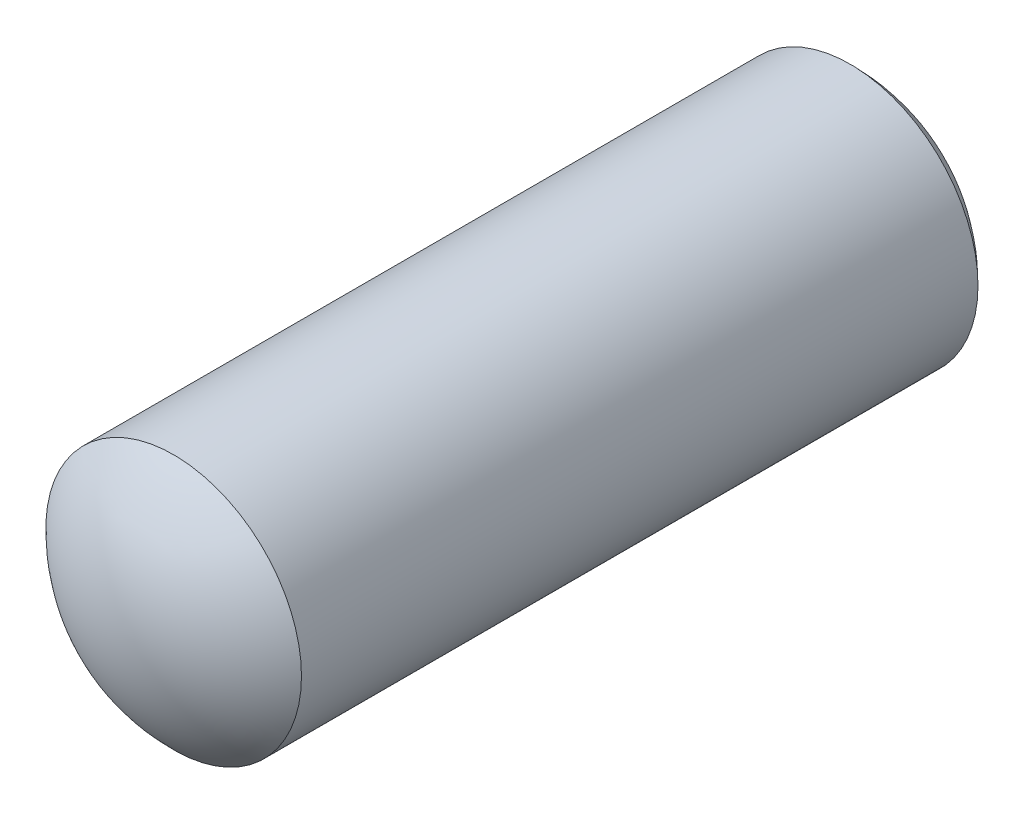
ISO-10303-21;
HEADER;
FILE_DESCRIPTION(('STEP AP214'),'2;1');
FILE_NAME('part.step','',(''),(''),'','','');
FILE_SCHEMA(('AUTOMOTIVE_DESIGN { 1 0 10303 214 1 1 1 1 }'));
ENDSEC;
DATA;
#1=APPLICATION_CONTEXT('core data for automotive mechanical design processes');
#2=APPLICATION_PROTOCOL_DEFINITION('international standard','automotive_design',2000,#1);
#3=PRODUCT_CONTEXT('',#1,'mechanical');
#4=PRODUCT('Part','Part','',(#3));
#5=PRODUCT_RELATED_PRODUCT_CATEGORY('part','',(#4));
#6=PRODUCT_DEFINITION_FORMATION('','',#4);
#7=PRODUCT_DEFINITION_CONTEXT('part definition',#1,'design');
#8=PRODUCT_DEFINITION('design','',#6,#7);
#9=PRODUCT_DEFINITION_SHAPE('','',#8);
#10=(LENGTH_UNIT() NAMED_UNIT(*) SI_UNIT(.MILLI.,.METRE.));
#11=(NAMED_UNIT(*) PLANE_ANGLE_UNIT() SI_UNIT($,.RADIAN.));
#12=(NAMED_UNIT(*) SI_UNIT($,.STERADIAN.) SOLID_ANGLE_UNIT());
#13=UNCERTAINTY_MEASURE_WITH_UNIT(LENGTH_MEASURE(1.E-05),#10,'distance_accuracy_value','');
#14=(GEOMETRIC_REPRESENTATION_CONTEXT(3) GLOBAL_UNCERTAINTY_ASSIGNED_CONTEXT((#13)) GLOBAL_UNIT_ASSIGNED_CONTEXT((#10,
#11,#12)) REPRESENTATION_CONTEXT('',''));
#15=CARTESIAN_POINT('',(0.,0.,0.));
#16=DIRECTION('',(0.,0.,1.));
#17=DIRECTION('',(1.,0.,0.));
#18=AXIS2_PLACEMENT_3D('',#15,#16,#17);
#19=CARTESIAN_POINT('',(2.57080958117809,8.75537338423227,7.875));
#20=DIRECTION('',(0.959492973614498,-0.281732556841429,0.));
#21=DIRECTION('',(0.,0.,1.));
#22=AXIS2_PLACEMENT_3D('',#19,#20,#21);
#23=SPHERICAL_SURFACE('',#22,1.575);
#24=CARTESIAN_POINT('',(2.57080958117809,8.75537338423227,7.875));
#25=DIRECTION('',(0.,0.,1.));
#26=DIRECTION('',(-0.281732556841429,-0.959492973614498,0.));
#27=AXIS2_PLACEMENT_3D('',#24,#25,#26);
#28=SPHERICAL_SURFACE('',#27,1.575);
#29=CARTESIAN_POINT('',(2.57080958117809,8.75537338423227,8.97727038425245));
#30=DIRECTION('',(0.,0.,1.));
#31=DIRECTION('',(-0.281732556841429,-0.959492973614498,0.));
#32=AXIS2_PLACEMENT_3D('',#29,#30,#31);
#33=CIRCLE('',#32,1.125);
#34=CARTESIAN_POINT('',(2.25386045473148,7.67594378891596,8.97727038425245));
#35=VERTEX_POINT('',#34);
#36=EDGE_CURVE('E11',#35,#35,#33,.T.);
#37=ORIENTED_EDGE('',*,*,#36,.T.);
#38=EDGE_LOOP('',(#37));
#39=FACE_BOUND('',#38,.T.);
#40=ADVANCED_FACE('F17',(#39),#28,.T.);
#41=CARTESIAN_POINT('',(2.57080958117809,8.75537338423227,6.));
#42=DIRECTION('',(0.,0.,1.));
#43=DIRECTION('',(-0.281732556841429,-0.959492973614498,0.));
#44=AXIS2_PLACEMENT_3D('',#41,#42,#43);
#45=CYLINDRICAL_SURFACE('',#44,1.125);
#46=CARTESIAN_POINT('',(2.57080958117809,8.75537338423227,3.02272961574759));
#47=DIRECTION('',(0.,0.,1.));
#48=DIRECTION('',(-0.281732556841429,-0.959492973614498,0.));
#49=AXIS2_PLACEMENT_3D('',#46,#47,#48);
#50=CIRCLE('',#49,1.125);
#51=CARTESIAN_POINT('',(2.25386045473148,7.67594378891596,3.02272961574759));
#52=VERTEX_POINT('',#51);
#53=EDGE_CURVE('E26',#52,#52,#50,.T.);
#54=ORIENTED_EDGE('',*,*,#53,.T.);
#55=EDGE_LOOP('',(#54));
#56=FACE_BOUND('',#55,.T.);
#57=ORIENTED_EDGE('',*,*,#36,.F.);
#58=EDGE_LOOP('',(#57));
#59=FACE_BOUND('',#58,.T.);
#60=ADVANCED_FACE('F40',(#56,#59),#45,.T.);
#61=CARTESIAN_POINT('',(2.57080958117809,8.75537338423227,4.125));
#62=DIRECTION('',(0.959492973614498,-0.281732556841429,0.));
#63=DIRECTION('',(0.,0.,-1.));
#64=AXIS2_PLACEMENT_3D('',#61,#62,#63);
#65=SPHERICAL_SURFACE('',#64,1.575);
#66=CARTESIAN_POINT('',(2.57080958117809,8.75537338423227,4.125));
#67=DIRECTION('',(0.,0.,1.));
#68=DIRECTION('',(-0.281732556841429,-0.959492973614498,0.));
#69=AXIS2_PLACEMENT_3D('',#66,#67,#68);
#70=SPHERICAL_SURFACE('',#69,1.575);
#71=ORIENTED_EDGE('',*,*,#53,.F.);
#72=EDGE_LOOP('',(#71));
#73=FACE_BOUND('',#72,.T.);
#74=ADVANCED_FACE('F19',(#73),#70,.T.);
#75=CLOSED_SHELL('',(#40,#60,#74));
#76=MANIFOLD_SOLID_BREP('B1',#75);
#77=ADVANCED_BREP_SHAPE_REPRESENTATION('',(#18,#76),#14);
#78=SHAPE_DEFINITION_REPRESENTATION(#9,#77);
ENDSEC;
END-ISO-10303-21;
